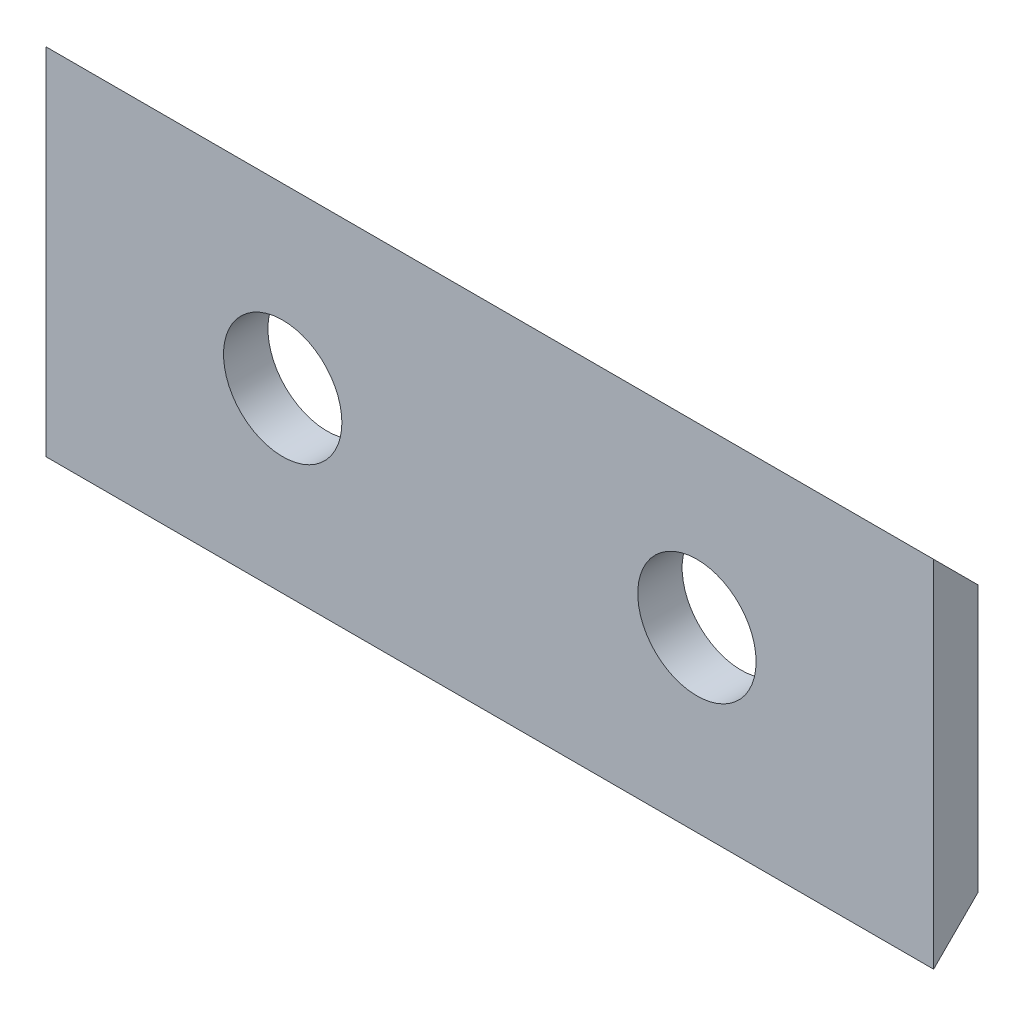
ISO-10303-21;
HEADER;
FILE_DESCRIPTION(('STEP AP214'),'2;1');
FILE_NAME('part.step','',(''),(''),'','','');
FILE_SCHEMA(('AUTOMOTIVE_DESIGN { 1 0 10303 214 1 1 1 1 }'));
ENDSEC;
DATA;
#1=APPLICATION_CONTEXT('core data for automotive mechanical design processes');
#2=APPLICATION_PROTOCOL_DEFINITION('international standard','automotive_design',2000,#1);
#3=PRODUCT_CONTEXT('',#1,'mechanical');
#4=PRODUCT('Part','Part','',(#3));
#5=PRODUCT_RELATED_PRODUCT_CATEGORY('part','',(#4));
#6=PRODUCT_DEFINITION_FORMATION('','',#4);
#7=PRODUCT_DEFINITION_CONTEXT('part definition',#1,'design');
#8=PRODUCT_DEFINITION('design','',#6,#7);
#9=PRODUCT_DEFINITION_SHAPE('','',#8);
#10=(LENGTH_UNIT() NAMED_UNIT(*) SI_UNIT(.MILLI.,.METRE.));
#11=(NAMED_UNIT(*) PLANE_ANGLE_UNIT() SI_UNIT($,.RADIAN.));
#12=(NAMED_UNIT(*) SI_UNIT($,.STERADIAN.) SOLID_ANGLE_UNIT());
#13=UNCERTAINTY_MEASURE_WITH_UNIT(LENGTH_MEASURE(1.E-05),#10,'distance_accuracy_value','');
#14=(GEOMETRIC_REPRESENTATION_CONTEXT(3) GLOBAL_UNCERTAINTY_ASSIGNED_CONTEXT((#13)) GLOBAL_UNIT_ASSIGNED_CONTEXT((#10,
#11,#12)) REPRESENTATION_CONTEXT('',''));
#15=CARTESIAN_POINT('',(0.,0.,0.));
#16=DIRECTION('',(0.,0.,1.));
#17=DIRECTION('',(1.,0.,0.));
#18=AXIS2_PLACEMENT_3D('',#15,#16,#17);
#19=CARTESIAN_POINT('',(0.,0.,1.5));
#20=DIRECTION('',(0.,0.,1.));
#21=DIRECTION('',(1.,0.,0.));
#22=AXIS2_PLACEMENT_3D('',#19,#20,#21);
#23=PLANE('',#22);
#24=CARTESIAN_POINT('',(-22.,6.,1.5));
#25=DIRECTION('',(0.,0.,1.));
#26=DIRECTION('',(1.,0.,0.));
#27=AXIS2_PLACEMENT_3D('',#24,#25,#26);
#28=CIRCLE('',#27,2.);
#29=CARTESIAN_POINT('',(-20.,6.,1.5));
#30=VERTEX_POINT('',#29);
#31=EDGE_CURVE('E97',#30,#30,#28,.T.);
#32=ORIENTED_EDGE('',*,*,#31,.F.);
#33=EDGE_LOOP('',(#32));
#34=FACE_BOUND('',#33,.T.);
#35=DIRECTION('',(0.,1.,0.));
#36=VECTOR('',#35,1.);
#37=CARTESIAN_POINT('',(0.,0.,1.5));
#38=LINE('',#37,#36);
#39=CARTESIAN_POINT('',(0.,0.,1.5));
#40=VERTEX_POINT('',#39);
#41=CARTESIAN_POINT('',(0.,12.,1.5));
#42=VERTEX_POINT('',#41);
#43=EDGE_CURVE('E93',#40,#42,#38,.T.);
#44=ORIENTED_EDGE('',*,*,#43,.T.);
#45=DIRECTION('',(-1.,0.,0.));
#46=VECTOR('',#45,1.);
#47=CARTESIAN_POINT('',(0.,12.,1.5));
#48=LINE('',#47,#46);
#49=CARTESIAN_POINT('',(-30.,12.,1.5));
#50=VERTEX_POINT('',#49);
#51=EDGE_CURVE('E95',#42,#50,#48,.T.);
#52=ORIENTED_EDGE('',*,*,#51,.T.);
#53=DIRECTION('',(0.,-1.,0.));
#54=VECTOR('',#53,1.);
#55=CARTESIAN_POINT('',(-30.,0.,1.5));
#56=LINE('',#55,#54);
#57=CARTESIAN_POINT('',(-30.,0.,1.5));
#58=VERTEX_POINT('',#57);
#59=EDGE_CURVE('E42',#50,#58,#56,.T.);
#60=ORIENTED_EDGE('',*,*,#59,.T.);
#61=DIRECTION('',(1.,0.,0.));
#62=VECTOR('',#61,1.);
#63=CARTESIAN_POINT('',(0.,0.,1.5));
#64=LINE('',#63,#62);
#65=EDGE_CURVE('E11',#58,#40,#64,.T.);
#66=ORIENTED_EDGE('',*,*,#65,.T.);
#67=EDGE_LOOP('',(#44,#52,#60,#66));
#68=FACE_BOUND('',#67,.T.);
#69=CARTESIAN_POINT('',(-8.,6.,1.5));
#70=DIRECTION('',(0.,0.,1.));
#71=DIRECTION('',(1.,0.,0.));
#72=AXIS2_PLACEMENT_3D('',#69,#70,#71);
#73=CIRCLE('',#72,2.);
#74=CARTESIAN_POINT('',(-6.,6.,1.5));
#75=VERTEX_POINT('',#74);
#76=EDGE_CURVE('E108',#75,#75,#73,.T.);
#77=ORIENTED_EDGE('',*,*,#76,.F.);
#78=EDGE_LOOP('',(#77));
#79=FACE_BOUND('',#78,.T.);
#80=ADVANCED_FACE('F33',(#34,#68,#79),#23,.T.);
#81=CARTESIAN_POINT('',(0.,0.,0.));
#82=DIRECTION('',(0.,0.,1.));
#83=DIRECTION('',(1.,0.,0.));
#84=AXIS2_PLACEMENT_3D('',#81,#82,#83);
#85=PLANE('',#84);
#86=CARTESIAN_POINT('',(-22.,6.,0.));
#87=DIRECTION('',(0.,0.,1.));
#88=DIRECTION('',(1.,0.,0.));
#89=AXIS2_PLACEMENT_3D('',#86,#87,#88);
#90=CIRCLE('',#89,2.);
#91=CARTESIAN_POINT('',(-20.,6.,0.));
#92=VERTEX_POINT('',#91);
#93=EDGE_CURVE('E101',#92,#92,#90,.T.);
#94=ORIENTED_EDGE('',*,*,#93,.T.);
#95=EDGE_LOOP('',(#94));
#96=FACE_BOUND('',#95,.T.);
#97=DIRECTION('',(0.,1.,0.));
#98=VECTOR('',#97,1.);
#99=CARTESIAN_POINT('',(0.,0.,0.));
#100=LINE('',#99,#98);
#101=CARTESIAN_POINT('',(0.,1.49999999999998,0.));
#102=VERTEX_POINT('',#101);
#103=CARTESIAN_POINT('',(0.,10.5,0.));
#104=VERTEX_POINT('',#103);
#105=EDGE_CURVE('E88',#102,#104,#100,.T.);
#106=ORIENTED_EDGE('',*,*,#105,.F.);
#107=DIRECTION('',(1.,0.,0.));
#108=VECTOR('',#107,1.);
#109=CARTESIAN_POINT('',(-30.,1.49999999999998,0.));
#110=LINE('',#109,#108);
#111=CARTESIAN_POINT('',(-30.,1.49999999999998,0.));
#112=VERTEX_POINT('',#111);
#113=EDGE_CURVE('E77',#112,#102,#110,.T.);
#114=ORIENTED_EDGE('',*,*,#113,.F.);
#115=DIRECTION('',(0.,-1.,0.));
#116=VECTOR('',#115,1.);
#117=CARTESIAN_POINT('',(-30.,0.,0.));
#118=LINE('',#117,#116);
#119=CARTESIAN_POINT('',(-30.,10.5,0.));
#120=VERTEX_POINT('',#119);
#121=EDGE_CURVE('E37',#120,#112,#118,.T.);
#122=ORIENTED_EDGE('',*,*,#121,.F.);
#123=DIRECTION('',(1.,0.,0.));
#124=VECTOR('',#123,1.);
#125=CARTESIAN_POINT('',(-30.,10.5,0.));
#126=LINE('',#125,#124);
#127=EDGE_CURVE('E50',#120,#104,#126,.T.);
#128=ORIENTED_EDGE('',*,*,#127,.T.);
#129=EDGE_LOOP('',(#106,#114,#122,#128));
#130=FACE_BOUND('',#129,.T.);
#131=CARTESIAN_POINT('',(-8.,6.,0.));
#132=DIRECTION('',(0.,0.,1.));
#133=DIRECTION('',(1.,0.,0.));
#134=AXIS2_PLACEMENT_3D('',#131,#132,#133);
#135=CIRCLE('',#134,2.);
#136=CARTESIAN_POINT('',(-6.,6.,0.));
#137=VERTEX_POINT('',#136);
#138=EDGE_CURVE('E110',#137,#137,#135,.T.);
#139=ORIENTED_EDGE('',*,*,#138,.T.);
#140=EDGE_LOOP('',(#139));
#141=FACE_BOUND('',#140,.T.);
#142=ADVANCED_FACE('F86',(#96,#130,#141),#85,.F.);
#143=CARTESIAN_POINT('',(0.,0.,1.5));
#144=DIRECTION('',(-1.,0.,0.));
#145=DIRECTION('',(0.,0.,1.));
#146=AXIS2_PLACEMENT_3D('',#143,#144,#145);
#147=PLANE('',#146);
#148=ORIENTED_EDGE('',*,*,#43,.F.);
#149=DIRECTION('',(0.,-0.707106781186544,0.707106781186551));
#150=VECTOR('',#149,1.);
#151=CARTESIAN_POINT('',(0.,1.49999999999998,0.));
#152=LINE('',#151,#150);
#153=EDGE_CURVE('E58',#102,#40,#152,.T.);
#154=ORIENTED_EDGE('',*,*,#153,.F.);
#155=ORIENTED_EDGE('',*,*,#105,.T.);
#156=DIRECTION('',(0.,-0.707106781186544,-0.707106781186551));
#157=VECTOR('',#156,1.);
#158=CARTESIAN_POINT('',(0.,12.,1.5));
#159=LINE('',#158,#157);
#160=EDGE_CURVE('E89',#42,#104,#159,.T.);
#161=ORIENTED_EDGE('',*,*,#160,.F.);
#162=EDGE_LOOP('',(#148,#154,#155,#161));
#163=FACE_BOUND('',#162,.T.);
#164=ADVANCED_FACE('F35',(#163),#147,.F.);
#165=CARTESIAN_POINT('',(-30.,0.,1.5));
#166=DIRECTION('',(1.,0.,0.));
#167=DIRECTION('',(0.,0.,-1.));
#168=AXIS2_PLACEMENT_3D('',#165,#166,#167);
#169=PLANE('',#168);
#170=ORIENTED_EDGE('',*,*,#121,.T.);
#171=DIRECTION('',(0.,-0.707106781186544,0.707106781186551));
#172=VECTOR('',#171,1.);
#173=CARTESIAN_POINT('',(-30.,1.49999999999998,0.));
#174=LINE('',#173,#172);
#175=EDGE_CURVE('E74',#112,#58,#174,.T.);
#176=ORIENTED_EDGE('',*,*,#175,.T.);
#177=ORIENTED_EDGE('',*,*,#59,.F.);
#178=DIRECTION('',(0.,-0.707106781186544,-0.707106781186551));
#179=VECTOR('',#178,1.);
#180=CARTESIAN_POINT('',(-30.,12.,1.5));
#181=LINE('',#180,#179);
#182=EDGE_CURVE('E92',#50,#120,#181,.T.);
#183=ORIENTED_EDGE('',*,*,#182,.T.);
#184=EDGE_LOOP('',(#170,#176,#177,#183));
#185=FACE_BOUND('',#184,.T.);
#186=ADVANCED_FACE('F91',(#185),#169,.F.);
#187=CARTESIAN_POINT('',(-22.,6.,1.5));
#188=DIRECTION('',(0.,0.,-1.));
#189=DIRECTION('',(-1.,0.,0.));
#190=AXIS2_PLACEMENT_3D('',#187,#188,#189);
#191=CYLINDRICAL_SURFACE('',#190,2.);
#192=ORIENTED_EDGE('',*,*,#31,.T.);
#193=EDGE_LOOP('',(#192));
#194=FACE_BOUND('',#193,.T.);
#195=ORIENTED_EDGE('',*,*,#93,.F.);
#196=EDGE_LOOP('',(#195));
#197=FACE_BOUND('',#196,.T.);
#198=ADVANCED_FACE('F130',(#194,#197),#191,.F.);
#199=CARTESIAN_POINT('',(-8.,6.,1.5));
#200=DIRECTION('',(0.,0.,-1.));
#201=DIRECTION('',(-1.,0.,0.));
#202=AXIS2_PLACEMENT_3D('',#199,#200,#201);
#203=CYLINDRICAL_SURFACE('',#202,2.);
#204=ORIENTED_EDGE('',*,*,#76,.T.);
#205=EDGE_LOOP('',(#204));
#206=FACE_BOUND('',#205,.T.);
#207=ORIENTED_EDGE('',*,*,#138,.F.);
#208=EDGE_LOOP('',(#207));
#209=FACE_BOUND('',#208,.T.);
#210=ADVANCED_FACE('F127',(#206,#209),#203,.F.);
#211=CARTESIAN_POINT('',(-30.,12.,1.5));
#212=DIRECTION('',(0.,-0.707106781186551,0.707106781186544));
#213=DIRECTION('',(0.,-0.707106781186544,-0.707106781186551));
#214=AXIS2_PLACEMENT_3D('',#211,#212,#213);
#215=PLANE('',#214);
#216=ORIENTED_EDGE('',*,*,#160,.T.);
#217=ORIENTED_EDGE('',*,*,#127,.F.);
#218=ORIENTED_EDGE('',*,*,#182,.F.);
#219=ORIENTED_EDGE('',*,*,#51,.F.);
#220=EDGE_LOOP('',(#216,#217,#218,#219));
#221=FACE_BOUND('',#220,.T.);
#222=ADVANCED_FACE('F118',(#221),#215,.F.);
#223=CARTESIAN_POINT('',(-30.,1.49999999999998,0.));
#224=DIRECTION('',(0.,0.707106781186551,0.707106781186544));
#225=DIRECTION('',(0.,-0.707106781186544,0.707106781186551));
#226=AXIS2_PLACEMENT_3D('',#223,#224,#225);
#227=PLANE('',#226);
#228=ORIENTED_EDGE('',*,*,#153,.T.);
#229=ORIENTED_EDGE('',*,*,#65,.F.);
#230=ORIENTED_EDGE('',*,*,#175,.F.);
#231=ORIENTED_EDGE('',*,*,#113,.T.);
#232=EDGE_LOOP('',(#228,#229,#230,#231));
#233=FACE_BOUND('',#232,.T.);
#234=ADVANCED_FACE('F76',(#233),#227,.F.);
#235=CLOSED_SHELL('',(#80,#142,#164,#186,#198,#210,#222,#234));
#236=MANIFOLD_SOLID_BREP('B2',#235);
#237=ADVANCED_BREP_SHAPE_REPRESENTATION('',(#18,#236),#14);
#238=SHAPE_DEFINITION_REPRESENTATION(#9,#237);
ENDSEC;
END-ISO-10303-21;
